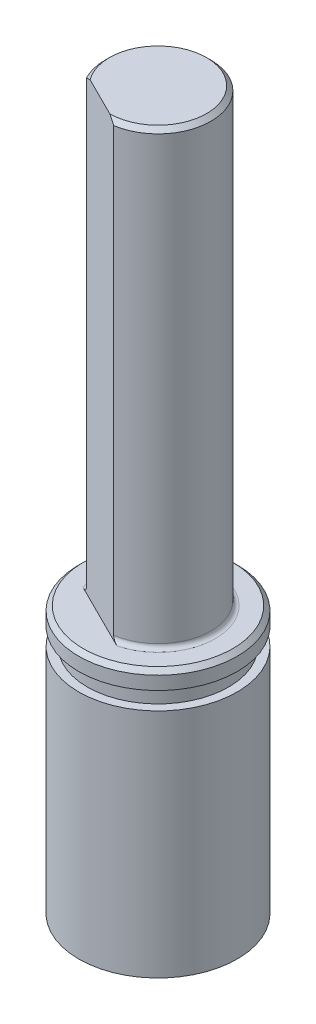
ISO-10303-21;
HEADER;
FILE_DESCRIPTION(('STEP AP214'),'2;1');
FILE_NAME('part.step','',(''),(''),'','','');
FILE_SCHEMA(('AUTOMOTIVE_DESIGN { 1 0 10303 214 1 1 1 1 }'));
ENDSEC;
DATA;
#1=APPLICATION_CONTEXT('core data for automotive mechanical design processes');
#2=APPLICATION_PROTOCOL_DEFINITION('international standard','automotive_design',2000,#1);
#3=PRODUCT_CONTEXT('',#1,'mechanical');
#4=PRODUCT('Part','Part','',(#3));
#5=PRODUCT_RELATED_PRODUCT_CATEGORY('part','',(#4));
#6=PRODUCT_DEFINITION_FORMATION('','',#4);
#7=PRODUCT_DEFINITION_CONTEXT('part definition',#1,'design');
#8=PRODUCT_DEFINITION('design','',#6,#7);
#9=PRODUCT_DEFINITION_SHAPE('','',#8);
#10=(LENGTH_UNIT() NAMED_UNIT(*) SI_UNIT(.MILLI.,.METRE.));
#11=(NAMED_UNIT(*) PLANE_ANGLE_UNIT() SI_UNIT($,.RADIAN.));
#12=(NAMED_UNIT(*) SI_UNIT($,.STERADIAN.) SOLID_ANGLE_UNIT());
#13=UNCERTAINTY_MEASURE_WITH_UNIT(LENGTH_MEASURE(1.E-05),#10,'distance_accuracy_value','');
#14=(GEOMETRIC_REPRESENTATION_CONTEXT(3) GLOBAL_UNCERTAINTY_ASSIGNED_CONTEXT((#13)) GLOBAL_UNIT_ASSIGNED_CONTEXT((#10,
#11,#12)) REPRESENTATION_CONTEXT('',''));
#15=CARTESIAN_POINT('',(0.,0.,0.));
#16=DIRECTION('',(0.,0.,1.));
#17=DIRECTION('',(1.,0.,0.));
#18=AXIS2_PLACEMENT_3D('',#15,#16,#17);
#19=CARTESIAN_POINT('',(0.,3.36,0.));
#20=DIRECTION('',(0.,1.,0.));
#21=DIRECTION('',(1.,0.,0.));
#22=AXIS2_PLACEMENT_3D('',#19,#20,#21);
#23=PLANE('',#22);
#24=CARTESIAN_POINT('',(0.,3.36,0.));
#25=DIRECTION('',(0.,1.,0.));
#26=DIRECTION('',(0.,0.,1.));
#27=AXIS2_PLACEMENT_3D('',#24,#25,#26);
#28=CIRCLE('',#27,4.485);
#29=CARTESIAN_POINT('',(0.,3.36,4.485));
#30=VERTEX_POINT('',#29);
#31=EDGE_CURVE('E34',#30,#30,#28,.T.);
#32=ORIENTED_EDGE('',*,*,#31,.F.);
#33=EDGE_LOOP('',(#32));
#34=FACE_BOUND('',#33,.T.);
#35=ADVANCED_FACE('F17',(#34),#23,.F.);
#36=CARTESIAN_POINT('',(-4.485,17.46,0.));
#37=DIRECTION('',(0.,1.,0.));
#38=DIRECTION('',(1.,0.,0.));
#39=AXIS2_PLACEMENT_3D('',#36,#37,#38);
#40=PLANE('',#39);
#41=CARTESIAN_POINT('',(0.,17.46,0.));
#42=DIRECTION('',(0.,1.,0.));
#43=DIRECTION('',(0.,0.,1.));
#44=AXIS2_PLACEMENT_3D('',#41,#42,#43);
#45=CIRCLE('',#44,4.);
#46=CARTESIAN_POINT('',(0.,17.46,4.));
#47=VERTEX_POINT('',#46);
#48=EDGE_CURVE('E191',#47,#47,#45,.T.);
#49=ORIENTED_EDGE('',*,*,#48,.T.);
#50=EDGE_LOOP('',(#49));
#51=FACE_BOUND('',#50,.T.);
#52=CARTESIAN_POINT('',(0.,17.46,0.));
#53=DIRECTION('',(0.,1.,0.));
#54=DIRECTION('',(0.,0.,1.));
#55=AXIS2_PLACEMENT_3D('',#52,#53,#54);
#56=CIRCLE('',#55,4.485);
#57=CARTESIAN_POINT('',(0.,17.46,4.485));
#58=VERTEX_POINT('',#57);
#59=EDGE_CURVE('E83',#58,#58,#56,.T.);
#60=ORIENTED_EDGE('',*,*,#59,.F.);
#61=EDGE_LOOP('',(#60));
#62=FACE_BOUND('',#61,.T.);
#63=ADVANCED_FACE('F19',(#51,#62),#40,.F.);
#64=CARTESIAN_POINT('',(-4.485,16.46,0.));
#65=DIRECTION('',(0.,-1.,0.));
#66=DIRECTION('',(0.,0.,-1.));
#67=AXIS2_PLACEMENT_3D('',#64,#65,#66);
#68=PLANE('',#67);
#69=CARTESIAN_POINT('',(0.,16.46,0.));
#70=DIRECTION('',(0.,1.,0.));
#71=DIRECTION('',(0.,0.,1.));
#72=AXIS2_PLACEMENT_3D('',#69,#70,#71);
#73=CIRCLE('',#72,4.);
#74=CARTESIAN_POINT('',(0.,16.46,4.));
#75=VERTEX_POINT('',#74);
#76=EDGE_CURVE('E195',#75,#75,#73,.T.);
#77=ORIENTED_EDGE('',*,*,#76,.F.);
#78=EDGE_LOOP('',(#77));
#79=FACE_BOUND('',#78,.T.);
#80=CARTESIAN_POINT('',(0.,16.46,0.));
#81=DIRECTION('',(0.,1.,0.));
#82=DIRECTION('',(0.,0.,1.));
#83=AXIS2_PLACEMENT_3D('',#80,#81,#82);
#84=CIRCLE('',#83,4.485);
#85=CARTESIAN_POINT('',(0.,16.46,4.485));
#86=VERTEX_POINT('',#85);
#87=EDGE_CURVE('E11',#86,#86,#84,.T.);
#88=ORIENTED_EDGE('',*,*,#87,.T.);
#89=EDGE_LOOP('',(#88));
#90=FACE_BOUND('',#89,.T.);
#91=ADVANCED_FACE('F134',(#79,#90),#68,.F.);
#92=CARTESIAN_POINT('',(0.,43.96,0.));
#93=DIRECTION('',(0.,-1.,0.));
#94=DIRECTION('',(0.,0.,-1.));
#95=AXIS2_PLACEMENT_3D('',#92,#93,#94);
#96=CYLINDRICAL_SURFACE('',#95,4.485);
#97=ORIENTED_EDGE('',*,*,#87,.F.);
#98=EDGE_LOOP('',(#97));
#99=FACE_BOUND('',#98,.T.);
#100=ORIENTED_EDGE('',*,*,#31,.T.);
#101=EDGE_LOOP('',(#100));
#102=FACE_BOUND('',#101,.T.);
#103=ADVANCED_FACE('F132',(#99,#102),#96,.T.);
#104=CARTESIAN_POINT('',(0.,0.,0.));
#105=DIRECTION('',(0.,1.,0.));
#106=DIRECTION('',(0.,0.,1.));
#107=AXIS2_PLACEMENT_3D('',#104,#105,#106);
#108=CYLINDRICAL_SURFACE('',#107,4.);
#109=ORIENTED_EDGE('',*,*,#76,.T.);
#110=EDGE_LOOP('',(#109));
#111=FACE_BOUND('',#110,.T.);
#112=ORIENTED_EDGE('',*,*,#48,.F.);
#113=EDGE_LOOP('',(#112));
#114=FACE_BOUND('',#113,.T.);
#115=ADVANCED_FACE('F128',(#111,#114),#108,.T.);
#116=CARTESIAN_POINT('',(0.,43.835,0.));
#117=DIRECTION('',(0.,-1.,0.));
#118=DIRECTION('',(0.446520316823429,0.,-0.894773494614086));
#119=AXIS2_PLACEMENT_3D('',#116,#117,#118);
#120=CONICAL_SURFACE('',#119,2.875,0.785398163397442);
#121=CARTESIAN_POINT('',(-2.64312204842072,43.71,1.41912150189905));
#122=CARTESIAN_POINT('',(-2.41795220374598,43.855229706158,1.53148838691347));
#123=CARTESIAN_POINT('',(-2.21154651279439,43.96,1.63449136484322));
#124=(BOUNDED_CURVE() B_SPLINE_CURVE(2,(#121,#122,#123),.UNSPECIFIED.,.F.,
.F.) B_SPLINE_CURVE_WITH_KNOTS((3,3),(0.,0.0543428902238779),
.UNSPECIFIED.) CURVE() GEOMETRIC_REPRESENTATION_ITEM() RATIONAL_B_SPLINE_CURVE((1.,
1.00353688601037,1.)) REPRESENTATION_ITEM(''));
#125=CARTESIAN_POINT('',(-2.64312204842074,43.71,1.41912150189904));
#126=VERTEX_POINT('',#125);
#127=CARTESIAN_POINT('',(-2.21154651279437,43.96,1.63449136484323));
#128=VERTEX_POINT('',#127);
#129=EDGE_CURVE('E109',#126,#128,#124,.T.);
#130=ORIENTED_EDGE('',*,*,#129,.T.);
#131=CARTESIAN_POINT('',(0.,43.96,0.));
#132=DIRECTION('',(0.,-1.,0.));
#133=DIRECTION('',(-1.,0.,0.));
#134=AXIS2_PLACEMENT_3D('',#131,#132,#133);
#135=CIRCLE('',#134,2.75);
#136=CARTESIAN_POINT('',(0.0235969603595625,43.96,2.74989875876583));
#137=VERTEX_POINT('',#136);
#138=EDGE_CURVE('E105',#128,#137,#135,.T.);
#139=ORIENTED_EDGE('',*,*,#138,.T.);
#140=CARTESIAN_POINT('',(0.0235969603595776,43.96,2.74989875876584));
#141=CARTESIAN_POINT('',(0.230002651311169,43.855229706158,2.85290173669559));
#142=CARTESIAN_POINT('',(0.455172495985911,43.71,2.96526862171001));
#143=(BOUNDED_CURVE() B_SPLINE_CURVE(2,(#140,#141,#142),.UNSPECIFIED.,.F.,
.F.) B_SPLINE_CURVE_WITH_KNOTS((3,3),(0.,0.054342890223878),
.UNSPECIFIED.) CURVE() GEOMETRIC_REPRESENTATION_ITEM() RATIONAL_B_SPLINE_CURVE((1.,
1.00353688601034,1.)) REPRESENTATION_ITEM(''));
#144=CARTESIAN_POINT('',(0.455172495985927,43.71,2.96526862171001));
#145=VERTEX_POINT('',#144);
#146=EDGE_CURVE('E111',#137,#145,#143,.T.);
#147=ORIENTED_EDGE('',*,*,#146,.T.);
#148=CARTESIAN_POINT('',(0.,43.71,0.));
#149=DIRECTION('',(0.,1.,0.));
#150=DIRECTION('',(-1.,0.,0.));
#151=AXIS2_PLACEMENT_3D('',#148,#149,#150);
#152=CIRCLE('',#151,3.);
#153=EDGE_CURVE('E104',#145,#126,#152,.T.);
#154=ORIENTED_EDGE('',*,*,#153,.T.);
#155=EDGE_LOOP('',(#130,#139,#147,#154));
#156=FACE_BOUND('',#155,.T.);
#157=ADVANCED_FACE('F131',(#156),#120,.T.);
#158=CARTESIAN_POINT('',(0.,18.46,0.));
#159=DIRECTION('',(0.,1.,0.));
#160=DIRECTION('',(0.446520316823429,0.,-0.894773494614086));
#161=AXIS2_PLACEMENT_3D('',#158,#159,#160);
#162=CYLINDRICAL_SURFACE('',#161,3.);
#163=DIRECTION('',(0.,1.,0.));
#164=VECTOR('',#163,1.);
#165=CARTESIAN_POINT('',(-2.64312204842074,18.46,1.41912150189904));
#166=LINE('',#165,#164);
#167=CARTESIAN_POINT('',(-2.64312204842074,18.71,1.41912150189904));
#168=VERTEX_POINT('',#167);
#169=EDGE_CURVE('E106',#168,#126,#166,.T.);
#170=ORIENTED_EDGE('',*,*,#169,.T.);
#171=ORIENTED_EDGE('',*,*,#153,.F.);
#172=DIRECTION('',(0.,-1.,0.));
#173=VECTOR('',#172,1.);
#174=CARTESIAN_POINT('',(0.455172495985927,18.46,2.96526862171001));
#175=LINE('',#174,#173);
#176=CARTESIAN_POINT('',(0.455172495985926,18.71,2.96526862171001));
#177=VERTEX_POINT('',#176);
#178=EDGE_CURVE('E82',#145,#177,#175,.T.);
#179=ORIENTED_EDGE('',*,*,#178,.T.);
#180=CARTESIAN_POINT('',(0.,18.71,0.));
#181=DIRECTION('',(0.,-1.,0.));
#182=DIRECTION('',(-1.,0.,0.));
#183=AXIS2_PLACEMENT_3D('',#180,#181,#182);
#184=CIRCLE('',#183,3.);
#185=EDGE_CURVE('E48',#168,#177,#184,.T.);
#186=ORIENTED_EDGE('',*,*,#185,.F.);
#187=EDGE_LOOP('',(#170,#171,#179,#186));
#188=FACE_BOUND('',#187,.T.);
#189=ADVANCED_FACE('F126',(#188),#162,.T.);
#190=CARTESIAN_POINT('',(0.,18.71,0.));
#191=DIRECTION('',(0.,-1.,0.));
#192=DIRECTION('',(0.,0.,-1.));
#193=AXIS2_PLACEMENT_3D('',#190,#191,#192);
#194=TOROIDAL_SURFACE('',#193,3.25,0.25);
#195=CARTESIAN_POINT('',(-3.00468810018502,18.46,1.23868858903542));
#196=CARTESIAN_POINT('',(-2.98990120257038,18.4600053320966,1.24606771933764));
#197=CARTESIAN_POINT('',(-2.97512779166364,18.4607067758052,1.2534401193454));
#198=CARTESIAN_POINT('',(-2.94566714526052,18.4634858130392,1.26814191510145));
#199=CARTESIAN_POINT('',(-2.93098003307612,18.4655650414065,1.27547124931316));
#200=CARTESIAN_POINT('',(-2.88691419887179,18.4738948413565,1.29746149641864));
#201=CARTESIAN_POINT('',(-2.85781369176909,18.4822370287723,1.31198357125595));
#202=CARTESIAN_POINT('',(-2.81195121222263,18.5006170625041,1.33487040129803));
#203=CARTESIAN_POINT('',(-2.79460757532917,18.5088856972411,1.34352542548812));
#204=CARTESIAN_POINT('',(-2.76112206886232,18.5280050629304,1.36023575390818));
#205=CARTESIAN_POINT('',(-2.74497643434238,18.5388472120459,1.36829293696575));
#206=CARTESIAN_POINT('',(-2.71979553232487,18.5593104268757,1.3808590047074));
#207=CARTESIAN_POINT('',(-2.71021270458744,18.5680877089682,1.38564113929581));
#208=CARTESIAN_POINT('',(-2.69225590723904,18.5870928217194,1.3946021499755));
#209=CARTESIAN_POINT('',(-2.68388066586981,18.5973191035303,1.39878166071444));
#210=CARTESIAN_POINT('',(-2.67096031348306,18.6163022651678,1.4052293258229));
#211=CARTESIAN_POINT('',(-2.66599376901912,18.6246981716591,1.40770778883159));
#212=CARTESIAN_POINT('',(-2.65731705917154,18.642245831291,1.41203774189061));
#213=CARTESIAN_POINT('',(-2.65360244816737,18.6513947632504,1.41389145044639));
#214=CARTESIAN_POINT('',(-2.64824134325897,18.6687072205945,1.41656681161504));
#215=CARTESIAN_POINT('',(-2.64635118391046,18.6767753357473,1.41751006100298));
#216=CARTESIAN_POINT('',(-2.64377777831831,18.6932201744137,1.41879427190913));
#217=CARTESIAN_POINT('',(-2.64310553575338,18.7015990203516,1.41912974224312));
#218=CARTESIAN_POINT('',(-2.64312204842073,18.71,1.41912150189905));
#219=B_SPLINE_CURVE_WITH_KNOTS('',3,(#195,#196,#197,#198,#199,#200,#201,#202,#203,#204,#205,
#206,#207,#208,#209,#210,#211,#212,#213,#214,#215,#216,#217,#218),.UNSPECIFIED.,.F.,.F.,(4,2,2,
2,2,2,2,2,2,2,2,4),(0.,0.0495338307841091,0.0991265425691222,0.199249153733525,0.26232929571651,
0.325201970070964,0.366640796135624,0.4080356574401,0.438130068539445,0.468116459711476,
0.493026035701461,0.518159564176533),.UNSPECIFIED.);
#220=CARTESIAN_POINT('',(-3.00468810018502,18.46,1.23868858903542));
#221=VERTEX_POINT('',#220);
#222=EDGE_CURVE('E72',#221,#168,#219,.T.);
#223=ORIENTED_EDGE('',*,*,#222,.T.);
#224=ORIENTED_EDGE('',*,*,#185,.T.);
#225=CARTESIAN_POINT('',(0.455172495985923,18.71,2.96526862171001));
#226=CARTESIAN_POINT('',(0.455140008417658,18.699765849737,2.96525240938437));
#227=CARTESIAN_POINT('',(0.456144784867451,18.6895825133641,2.9657538246603));
#228=CARTESIAN_POINT('',(0.459920187014749,18.6697709329696,2.96763786992214));
#229=CARTESIAN_POINT('',(0.462666453022018,18.6601369987321,2.96900834365099));
#230=CARTESIAN_POINT('',(0.469610965822715,18.641633581898,2.97247387551422));
#231=CARTESIAN_POINT('',(0.473800802070422,18.6327600350707,2.97456473651985));
#232=CARTESIAN_POINT('',(0.483315615032892,18.6157800541948,2.9793129295811));
#233=CARTESIAN_POINT('',(0.488644803185984,18.6076766318632,2.98197236327785));
#234=CARTESIAN_POINT('',(0.503724487902222,18.5874972499746,2.98949760361814));
#235=CARTESIAN_POINT('',(0.514168374908004,18.576071274167,2.99470943405652));
#236=CARTESIAN_POINT('',(0.536480579559677,18.5551300055299,3.00584393094324));
#237=CARTESIAN_POINT('',(0.548352275008943,18.5456193917993,3.01176828302244));
#238=CARTESIAN_POINT('',(0.580512662919925,18.5230371284454,3.02781733530843));
#239=CARTESIAN_POINT('',(0.601546683525332,18.5112943354701,3.03831397786806));
#240=CARTESIAN_POINT('',(0.644965592947742,18.491527376964,3.05998138901526));
#241=CARTESIAN_POINT('',(0.667353274875863,18.4835112188302,3.07115355145376));
#242=CARTESIAN_POINT('',(0.710883927859017,18.4714811997448,3.09287672617738));
#243=CARTESIAN_POINT('',(0.731963566801006,18.4671776989023,3.10339613373198));
#244=CARTESIAN_POINT('',(0.774277092454131,18.4614596864304,3.12451192336397));
#245=CARTESIAN_POINT('',(0.795508694243475,18.4600240976575,3.135107165193));
#246=CARTESIAN_POINT('',(0.816738547750211,18.46,3.14570153457364));
#247=B_SPLINE_CURVE_WITH_KNOTS('',3,(#225,#226,#227,#228,#229,#230,#231,#232,#233,#234,#235,
#236,#237,#238,#239,#240,#241,#242,#243,#244,#245,#246),.UNSPECIFIED.,.F.,.F.,(4,2,2,2,2,2,2,2,
2,2,4),(0.,0.0305606840242994,0.0607030450646322,0.0906726796489689,0.120755069154247,
0.169478639655176,0.218319831992705,0.296723222742911,0.375294308484623,0.446965839058705,
0.51810866734093),.UNSPECIFIED.);
#248=CARTESIAN_POINT('',(0.816738547750209,18.46,3.14570153457364));
#249=VERTEX_POINT('',#248);
#250=EDGE_CURVE('E21',#177,#249,#247,.T.);
#251=ORIENTED_EDGE('',*,*,#250,.T.);
#252=CARTESIAN_POINT('',(0.,18.46,0.));
#253=DIRECTION('',(0.,1.,0.));
#254=DIRECTION('',(-1.,0.,0.));
#255=AXIS2_PLACEMENT_3D('',#252,#253,#254);
#256=CIRCLE('',#255,3.25);
#257=EDGE_CURVE('E79',#249,#221,#256,.T.);
#258=ORIENTED_EDGE('',*,*,#257,.T.);
#259=EDGE_LOOP('',(#223,#224,#251,#258));
#260=FACE_BOUND('',#259,.T.);
#261=ADVANCED_FACE('F77',(#260),#194,.F.);
#262=CARTESIAN_POINT('',(0.,43.96,0.));
#263=DIRECTION('',(0.,1.,0.));
#264=DIRECTION('',(1.,0.,0.));
#265=AXIS2_PLACEMENT_3D('',#262,#263,#264);
#266=PLANE('',#265);
#267=DIRECTION('',(0.894773494614087,0.,0.446520316823429));
#268=VECTOR('',#267,1.);
#269=CARTESIAN_POINT('',(0.586718855773253,43.96,3.03091442213075));
#270=LINE('',#269,#268);
#271=EDGE_CURVE('E164',#128,#137,#270,.T.);
#272=ORIENTED_EDGE('',*,*,#271,.T.);
#273=ORIENTED_EDGE('',*,*,#138,.F.);
#274=EDGE_LOOP('',(#272,#273));
#275=FACE_BOUND('',#274,.T.);
#276=ADVANCED_FACE('F125',(#275),#266,.T.);
#277=CARTESIAN_POINT('',(2.26741248776391,18.46,3.86963378245698));
#278=DIRECTION('',(0.446520316823429,0.,-0.894773494614087));
#279=DIRECTION('',(0.,-1.,0.));
#280=AXIS2_PLACEMENT_3D('',#277,#278,#279);
#281=PLANE('',#280);
#282=ORIENTED_EDGE('',*,*,#250,.F.);
#283=ORIENTED_EDGE('',*,*,#178,.F.);
#284=ORIENTED_EDGE('',*,*,#146,.F.);
#285=ORIENTED_EDGE('',*,*,#271,.F.);
#286=ORIENTED_EDGE('',*,*,#129,.F.);
#287=ORIENTED_EDGE('',*,*,#169,.F.);
#288=ORIENTED_EDGE('',*,*,#222,.F.);
#289=DIRECTION('',(-0.894773494614087,0.,-0.446520316823429));
#290=VECTOR('',#289,1.);
#291=CARTESIAN_POINT('',(2.26741248776391,18.46,3.86963378245698));
#292=LINE('',#291,#290);
#293=EDGE_CURVE('E84',#249,#221,#292,.T.);
#294=ORIENTED_EDGE('',*,*,#293,.F.);
#295=EDGE_LOOP('',(#282,#283,#284,#285,#286,#287,#288,#294));
#296=FACE_BOUND('',#295,.T.);
#297=ADVANCED_FACE('F85',(#296),#281,.F.);
#298=CARTESIAN_POINT('',(0.,43.96,0.));
#299=DIRECTION('',(0.,-1.,0.));
#300=DIRECTION('',(0.,0.,-1.));
#301=AXIS2_PLACEMENT_3D('',#298,#299,#300);
#302=CYLINDRICAL_SURFACE('',#301,4.485);
#303=CARTESIAN_POINT('',(0.,18.21,0.));
#304=DIRECTION('',(0.,1.,0.));
#305=DIRECTION('',(0.,0.,-1.));
#306=AXIS2_PLACEMENT_3D('',#303,#304,#305);
#307=CIRCLE('',#306,4.485);
#308=CARTESIAN_POINT('',(0.,18.21,-4.485));
#309=VERTEX_POINT('',#308);
#310=EDGE_CURVE('E92',#309,#309,#307,.T.);
#311=ORIENTED_EDGE('',*,*,#310,.F.);
#312=EDGE_LOOP('',(#311));
#313=FACE_BOUND('',#312,.T.);
#314=ORIENTED_EDGE('',*,*,#59,.T.);
#315=EDGE_LOOP('',(#314));
#316=FACE_BOUND('',#315,.T.);
#317=ADVANCED_FACE('F124',(#313,#316),#302,.T.);
#318=CARTESIAN_POINT('',(0.,18.46,0.));
#319=DIRECTION('',(0.,1.,0.));
#320=DIRECTION('',(1.,0.,0.));
#321=AXIS2_PLACEMENT_3D('',#318,#319,#320);
#322=PLANE('',#321);
#323=ORIENTED_EDGE('',*,*,#257,.F.);
#324=ORIENTED_EDGE('',*,*,#293,.T.);
#325=EDGE_LOOP('',(#323,#324));
#326=FACE_BOUND('',#325,.T.);
#327=CARTESIAN_POINT('',(0.,18.46,0.));
#328=DIRECTION('',(0.,-1.,0.));
#329=DIRECTION('',(0.,0.,-1.));
#330=AXIS2_PLACEMENT_3D('',#327,#328,#329);
#331=CIRCLE('',#330,4.235);
#332=CARTESIAN_POINT('',(0.,18.46,-4.235));
#333=VERTEX_POINT('',#332);
#334=EDGE_CURVE('E99',#333,#333,#331,.T.);
#335=ORIENTED_EDGE('',*,*,#334,.F.);
#336=EDGE_LOOP('',(#335));
#337=FACE_BOUND('',#336,.T.);
#338=ADVANCED_FACE('F89',(#326,#337),#322,.T.);
#339=CARTESIAN_POINT('',(0.,18.335,0.));
#340=DIRECTION('',(0.,-1.,0.));
#341=DIRECTION('',(0.,0.,-1.));
#342=AXIS2_PLACEMENT_3D('',#339,#340,#341);
#343=CONICAL_SURFACE('',#342,4.36,0.785398163397451);
#344=ORIENTED_EDGE('',*,*,#310,.T.);
#345=EDGE_LOOP('',(#344));
#346=FACE_BOUND('',#345,.T.);
#347=ORIENTED_EDGE('',*,*,#334,.T.);
#348=EDGE_LOOP('',(#347));
#349=FACE_BOUND('',#348,.T.);
#350=ADVANCED_FACE('F152',(#346,#349),#343,.T.);
#351=CLOSED_SHELL('',(#35,#63,#91,#103,#115,#157,#189,#261,#276,#297,#317,#338,#350));
#352=MANIFOLD_SOLID_BREP('B1',#351);
#353=ADVANCED_BREP_SHAPE_REPRESENTATION('',(#18,#352),#14);
#354=SHAPE_DEFINITION_REPRESENTATION(#9,#353);
ENDSEC;
END-ISO-10303-21;
